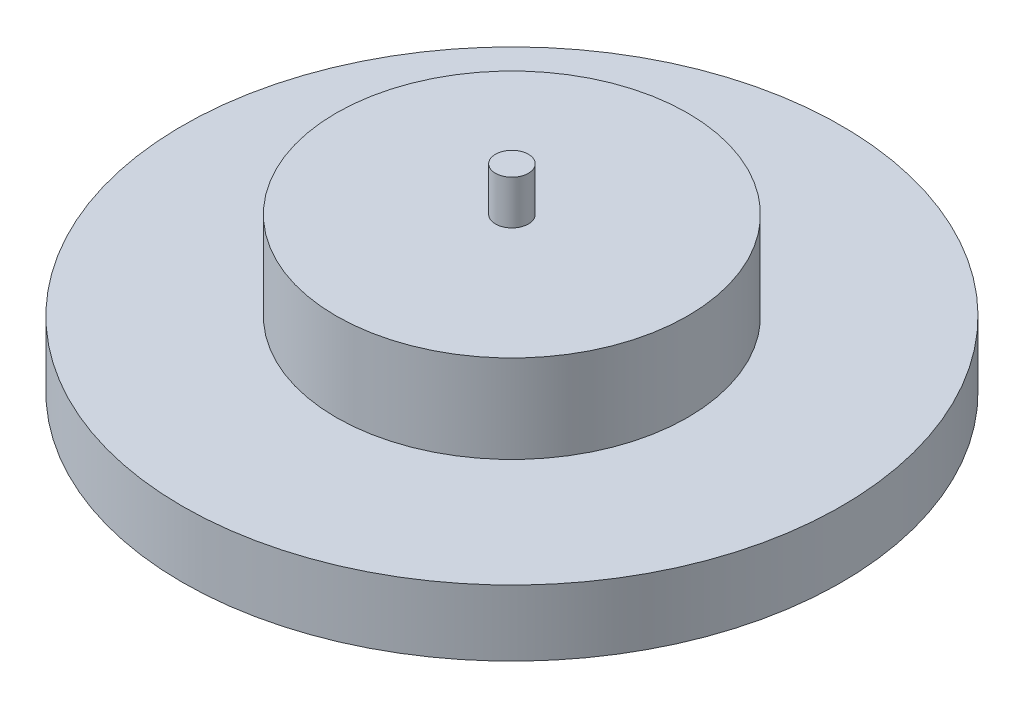
ISO-10303-21;
HEADER;
FILE_DESCRIPTION(('STEP AP214'),'2;1');
FILE_NAME('part.step','',(''),(''),'','','');
FILE_SCHEMA(('AUTOMOTIVE_DESIGN { 1 0 10303 214 1 1 1 1 }'));
ENDSEC;
DATA;
#1=APPLICATION_CONTEXT('core data for automotive mechanical design processes');
#2=APPLICATION_PROTOCOL_DEFINITION('international standard','automotive_design',2000,#1);
#3=PRODUCT_CONTEXT('',#1,'mechanical');
#4=PRODUCT('Part','Part','',(#3));
#5=PRODUCT_RELATED_PRODUCT_CATEGORY('part','',(#4));
#6=PRODUCT_DEFINITION_FORMATION('','',#4);
#7=PRODUCT_DEFINITION_CONTEXT('part definition',#1,'design');
#8=PRODUCT_DEFINITION('design','',#6,#7);
#9=PRODUCT_DEFINITION_SHAPE('','',#8);
#10=(LENGTH_UNIT() NAMED_UNIT(*) SI_UNIT(.MILLI.,.METRE.));
#11=(NAMED_UNIT(*) PLANE_ANGLE_UNIT() SI_UNIT($,.RADIAN.));
#12=(NAMED_UNIT(*) SI_UNIT($,.STERADIAN.) SOLID_ANGLE_UNIT());
#13=UNCERTAINTY_MEASURE_WITH_UNIT(LENGTH_MEASURE(1.E-05),#10,'distance_accuracy_value','');
#14=(GEOMETRIC_REPRESENTATION_CONTEXT(3) GLOBAL_UNCERTAINTY_ASSIGNED_CONTEXT((#13)) GLOBAL_UNIT_ASSIGNED_CONTEXT((#10,
#11,#12)) REPRESENTATION_CONTEXT('',''));
#15=CARTESIAN_POINT('',(0.,0.,0.));
#16=DIRECTION('',(0.,0.,1.));
#17=DIRECTION('',(1.,0.,0.));
#18=AXIS2_PLACEMENT_3D('',#15,#16,#17);
#19=CARTESIAN_POINT('',(0.,3.,0.));
#20=DIRECTION('',(0.,-1.,0.));
#21=DIRECTION('',(0.,0.,-1.));
#22=AXIS2_PLACEMENT_3D('',#19,#20,#21);
#23=CYLINDRICAL_SURFACE('',#22,15.);
#24=CARTESIAN_POINT('',(0.,3.,0.));
#25=DIRECTION('',(0.,1.,0.));
#26=DIRECTION('',(0.,0.,1.));
#27=AXIS2_PLACEMENT_3D('',#24,#25,#26);
#28=CIRCLE('',#27,15.);
#29=CARTESIAN_POINT('',(0.,3.,15.));
#30=VERTEX_POINT('',#29);
#31=EDGE_CURVE('E45',#30,#30,#28,.T.);
#32=ORIENTED_EDGE('',*,*,#31,.F.);
#33=EDGE_LOOP('',(#32));
#34=FACE_BOUND('',#33,.T.);
#35=CARTESIAN_POINT('',(0.,0.,0.));
#36=DIRECTION('',(0.,1.,0.));
#37=DIRECTION('',(0.,0.,1.));
#38=AXIS2_PLACEMENT_3D('',#35,#36,#37);
#39=CIRCLE('',#38,15.);
#40=CARTESIAN_POINT('',(0.,0.,15.));
#41=VERTEX_POINT('',#40);
#42=EDGE_CURVE('E41',#41,#41,#39,.T.);
#43=ORIENTED_EDGE('',*,*,#42,.T.);
#44=EDGE_LOOP('',(#43));
#45=FACE_BOUND('',#44,.T.);
#46=ADVANCED_FACE('F38',(#34,#45),#23,.T.);
#47=CARTESIAN_POINT('',(0.,3.,0.));
#48=DIRECTION('',(0.,1.,0.));
#49=DIRECTION('',(0.,0.,1.));
#50=AXIS2_PLACEMENT_3D('',#47,#48,#49);
#51=PLANE('',#50);
#52=CARTESIAN_POINT('',(0.,3.,0.));
#53=DIRECTION('',(0.,1.,0.));
#54=DIRECTION('',(0.,0.,1.));
#55=AXIS2_PLACEMENT_3D('',#52,#53,#54);
#56=CIRCLE('',#55,8.);
#57=CARTESIAN_POINT('',(0.,3.,8.));
#58=VERTEX_POINT('',#57);
#59=EDGE_CURVE('E10',#58,#58,#56,.T.);
#60=ORIENTED_EDGE('',*,*,#59,.F.);
#61=EDGE_LOOP('',(#60));
#62=FACE_BOUND('',#61,.T.);
#63=ORIENTED_EDGE('',*,*,#31,.T.);
#64=EDGE_LOOP('',(#63));
#65=FACE_BOUND('',#64,.T.);
#66=ADVANCED_FACE('F83',(#62,#65),#51,.T.);
#67=CARTESIAN_POINT('',(0.,0.,0.));
#68=DIRECTION('',(0.,1.,0.));
#69=DIRECTION('',(0.,0.,1.));
#70=AXIS2_PLACEMENT_3D('',#67,#68,#69);
#71=PLANE('',#70);
#72=ORIENTED_EDGE('',*,*,#42,.F.);
#73=EDGE_LOOP('',(#72));
#74=FACE_BOUND('',#73,.T.);
#75=ADVANCED_FACE('F77',(#74),#71,.F.);
#76=CARTESIAN_POINT('',(0.,7.,0.));
#77=DIRECTION('',(0.,-1.,0.));
#78=DIRECTION('',(0.,0.,-1.));
#79=AXIS2_PLACEMENT_3D('',#76,#77,#78);
#80=CYLINDRICAL_SURFACE('',#79,8.);
#81=CARTESIAN_POINT('',(0.,7.,0.));
#82=DIRECTION('',(0.,1.,0.));
#83=DIRECTION('',(0.,0.,1.));
#84=AXIS2_PLACEMENT_3D('',#81,#82,#83);
#85=CIRCLE('',#84,8.);
#86=CARTESIAN_POINT('',(0.,7.,8.));
#87=VERTEX_POINT('',#86);
#88=EDGE_CURVE('E51',#87,#87,#85,.T.);
#89=ORIENTED_EDGE('',*,*,#88,.F.);
#90=EDGE_LOOP('',(#89));
#91=FACE_BOUND('',#90,.T.);
#92=ORIENTED_EDGE('',*,*,#59,.T.);
#93=EDGE_LOOP('',(#92));
#94=FACE_BOUND('',#93,.T.);
#95=ADVANCED_FACE('F72',(#91,#94),#80,.T.);
#96=CARTESIAN_POINT('',(0.,7.,0.));
#97=DIRECTION('',(0.,1.,0.));
#98=DIRECTION('',(0.,0.,1.));
#99=AXIS2_PLACEMENT_3D('',#96,#97,#98);
#100=PLANE('',#99);
#101=CARTESIAN_POINT('',(0.,7.,0.));
#102=DIRECTION('',(0.,1.,0.));
#103=DIRECTION('',(0.,0.,1.));
#104=AXIS2_PLACEMENT_3D('',#101,#102,#103);
#105=CIRCLE('',#104,0.75);
#106=CARTESIAN_POINT('',(0.,7.,0.75));
#107=VERTEX_POINT('',#106);
#108=EDGE_CURVE('E55',#107,#107,#105,.T.);
#109=ORIENTED_EDGE('',*,*,#108,.F.);
#110=EDGE_LOOP('',(#109));
#111=FACE_BOUND('',#110,.T.);
#112=ORIENTED_EDGE('',*,*,#88,.T.);
#113=EDGE_LOOP('',(#112));
#114=FACE_BOUND('',#113,.T.);
#115=ADVANCED_FACE('F66',(#111,#114),#100,.T.);
#116=CARTESIAN_POINT('',(0.,9.,0.));
#117=DIRECTION('',(0.,-1.,0.));
#118=DIRECTION('',(0.,0.,-1.));
#119=AXIS2_PLACEMENT_3D('',#116,#117,#118);
#120=CYLINDRICAL_SURFACE('',#119,0.75);
#121=CARTESIAN_POINT('',(0.,9.,0.));
#122=DIRECTION('',(0.,1.,0.));
#123=DIRECTION('',(0.,0.,1.));
#124=AXIS2_PLACEMENT_3D('',#121,#122,#123);
#125=CIRCLE('',#124,0.75);
#126=CARTESIAN_POINT('',(0.,9.,0.75));
#127=VERTEX_POINT('',#126);
#128=EDGE_CURVE('E54',#127,#127,#125,.T.);
#129=ORIENTED_EDGE('',*,*,#128,.F.);
#130=EDGE_LOOP('',(#129));
#131=FACE_BOUND('',#130,.T.);
#132=ORIENTED_EDGE('',*,*,#108,.T.);
#133=EDGE_LOOP('',(#132));
#134=FACE_BOUND('',#133,.T.);
#135=ADVANCED_FACE('F63',(#131,#134),#120,.T.);
#136=CARTESIAN_POINT('',(0.,9.,0.));
#137=DIRECTION('',(0.,1.,0.));
#138=DIRECTION('',(0.,0.,1.));
#139=AXIS2_PLACEMENT_3D('',#136,#137,#138);
#140=PLANE('',#139);
#141=ORIENTED_EDGE('',*,*,#128,.T.);
#142=EDGE_LOOP('',(#141));
#143=FACE_BOUND('',#142,.T.);
#144=ADVANCED_FACE('F61',(#143),#140,.T.);
#145=CLOSED_SHELL('',(#46,#66,#75,#95,#115,#135,#144));
#146=MANIFOLD_SOLID_BREP('B2',#145);
#147=ADVANCED_BREP_SHAPE_REPRESENTATION('',(#18,#146),#14);
#148=SHAPE_DEFINITION_REPRESENTATION(#9,#147);
ENDSEC;
END-ISO-10303-21;
